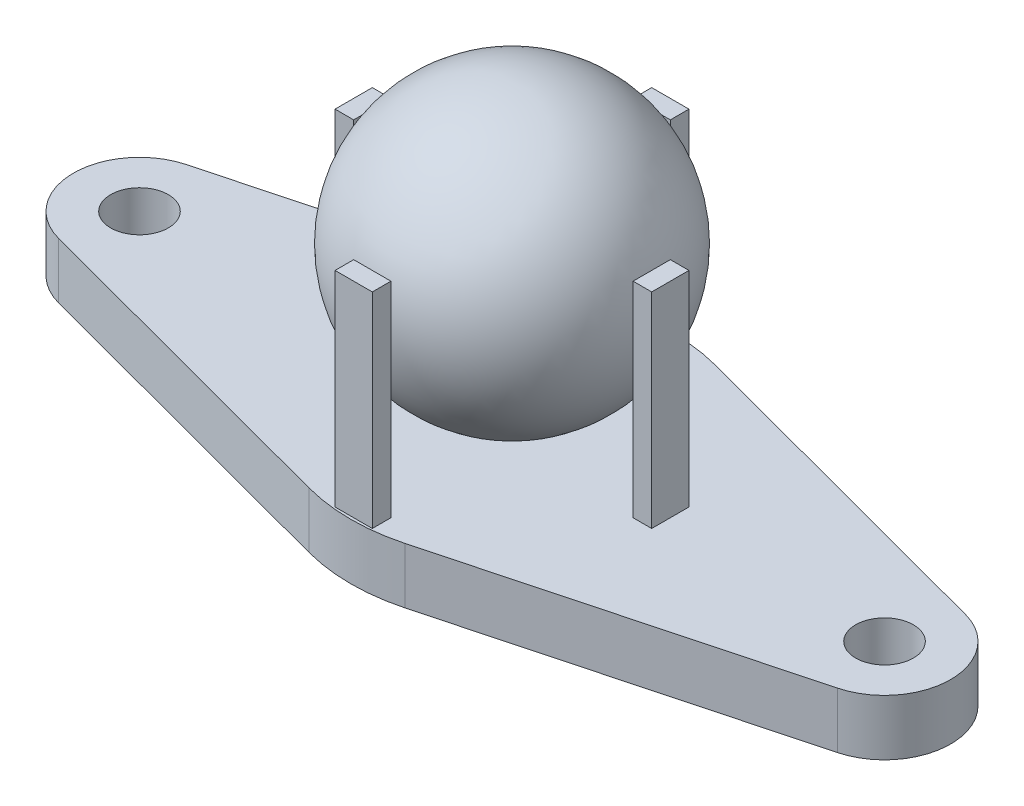
ISO-10303-21;
HEADER;
FILE_DESCRIPTION(('STEP AP214'),'2;1');
FILE_NAME('part.step','',(''),(''),'','','');
FILE_SCHEMA(('AUTOMOTIVE_DESIGN { 1 0 10303 214 1 1 1 1 }'));
ENDSEC;
DATA;
#1=APPLICATION_CONTEXT('core data for automotive mechanical design processes');
#2=APPLICATION_PROTOCOL_DEFINITION('international standard','automotive_design',2000,#1);
#3=PRODUCT_CONTEXT('',#1,'mechanical');
#4=PRODUCT('Part','Part','',(#3));
#5=PRODUCT_RELATED_PRODUCT_CATEGORY('part','',(#4));
#6=PRODUCT_DEFINITION_FORMATION('','',#4);
#7=PRODUCT_DEFINITION_CONTEXT('part definition',#1,'design');
#8=PRODUCT_DEFINITION('design','',#6,#7);
#9=PRODUCT_DEFINITION_SHAPE('','',#8);
#10=(LENGTH_UNIT() NAMED_UNIT(*) SI_UNIT(.MILLI.,.METRE.));
#11=(NAMED_UNIT(*) PLANE_ANGLE_UNIT() SI_UNIT($,.RADIAN.));
#12=(NAMED_UNIT(*) SI_UNIT($,.STERADIAN.) SOLID_ANGLE_UNIT());
#13=UNCERTAINTY_MEASURE_WITH_UNIT(LENGTH_MEASURE(1.E-05),#10,'distance_accuracy_value','');
#14=(GEOMETRIC_REPRESENTATION_CONTEXT(3) GLOBAL_UNCERTAINTY_ASSIGNED_CONTEXT((#13)) GLOBAL_UNIT_ASSIGNED_CONTEXT((#10,
#11,#12)) REPRESENTATION_CONTEXT('',''));
#15=CARTESIAN_POINT('',(0.,0.,0.));
#16=DIRECTION('',(0.,0.,1.));
#17=DIRECTION('',(1.,0.,0.));
#18=AXIS2_PLACEMENT_3D('',#15,#16,#17);
#19=CARTESIAN_POINT('',(0.,11.5,0.));
#20=DIRECTION('',(0.,-1.,0.));
#21=DIRECTION('',(-1.,0.,0.));
#22=AXIS2_PLACEMENT_3D('',#19,#20,#21);
#23=SPHERICAL_SURFACE('',#22,7.5);
#24=CARTESIAN_POINT('',(0.,4.,0.));
#25=VERTEX_POINT('',#24);
#26=VERTEX_LOOP('',#25);
#27=FACE_BOUND('',#26,.T.);
#28=ADVANCED_FACE('F52',(#27),#23,.T.);
#29=CLOSED_SHELL('',(#28));
#30=MANIFOLD_SOLID_BREP('B2',#29);
#31=CARTESIAN_POINT('',(-20.,3.,0.));
#32=DIRECTION('',(0.,-1.,0.));
#33=DIRECTION('',(0.,0.,-1.));
#34=AXIS2_PLACEMENT_3D('',#31,#32,#33);
#35=PLANE('',#34);
#36=DIRECTION('',(0.,0.,-1.));
#37=VECTOR('',#36,1.);
#38=CARTESIAN_POINT('',(1.00000000000175,3.,8.4999999999998));
#39=LINE('',#38,#37);
#40=CARTESIAN_POINT('',(1.00000000000175,3.,8.4999999999998));
#41=VERTEX_POINT('',#40);
#42=CARTESIAN_POINT('',(1.00000000000175,3.,7.4999999999998));
#43=VERTEX_POINT('',#42);
#44=EDGE_CURVE('E252',#41,#43,#39,.T.);
#45=ORIENTED_EDGE('',*,*,#44,.F.);
#46=DIRECTION('',(1.,0.,0.));
#47=VECTOR('',#46,1.);
#48=CARTESIAN_POINT('',(1.00000000000175,3.,8.4999999999998));
#49=LINE('',#48,#47);
#50=CARTESIAN_POINT('',(-0.999999999998252,3.,8.4999999999998));
#51=VERTEX_POINT('',#50);
#52=EDGE_CURVE('E270',#51,#41,#49,.T.);
#53=ORIENTED_EDGE('',*,*,#52,.F.);
#54=DIRECTION('',(0.,0.,1.));
#55=VECTOR('',#54,1.);
#56=CARTESIAN_POINT('',(-0.999999999998252,3.,8.4999999999998));
#57=LINE('',#56,#55);
#58=CARTESIAN_POINT('',(-0.999999999998252,3.,7.4999999999998));
#59=VERTEX_POINT('',#58);
#60=EDGE_CURVE('E283',#59,#51,#57,.T.);
#61=ORIENTED_EDGE('',*,*,#60,.F.);
#62=DIRECTION('',(-1.,0.,0.));
#63=VECTOR('',#62,1.);
#64=CARTESIAN_POINT('',(1.00000000000175,3.,7.4999999999998));
#65=LINE('',#64,#63);
#66=EDGE_CURVE('E258',#43,#59,#65,.T.);
#67=ORIENTED_EDGE('',*,*,#66,.F.);
#68=EDGE_LOOP('',(#45,#53,#61,#67));
#69=FACE_BOUND('',#68,.T.);
#70=DIRECTION('',(0.,0.,1.));
#71=VECTOR('',#70,1.);
#72=CARTESIAN_POINT('',(-1.,3.,-8.50000000000001));
#73=LINE('',#72,#71);
#74=CARTESIAN_POINT('',(-1.,3.,-8.50000000000001));
#75=VERTEX_POINT('',#74);
#76=CARTESIAN_POINT('',(-1.,3.,-7.50000000000001));
#77=VERTEX_POINT('',#76);
#78=EDGE_CURVE('E350',#75,#77,#73,.T.);
#79=ORIENTED_EDGE('',*,*,#78,.F.);
#80=DIRECTION('',(-1.,0.,0.));
#81=VECTOR('',#80,1.);
#82=CARTESIAN_POINT('',(-1.,3.,-8.50000000000001));
#83=LINE('',#82,#81);
#84=CARTESIAN_POINT('',(1.,3.,-8.50000000000001));
#85=VERTEX_POINT('',#84);
#86=EDGE_CURVE('E356',#85,#75,#83,.T.);
#87=ORIENTED_EDGE('',*,*,#86,.F.);
#88=DIRECTION('',(0.,0.,-1.));
#89=VECTOR('',#88,1.);
#90=CARTESIAN_POINT('',(1.,3.,-8.50000000000001));
#91=LINE('',#90,#89);
#92=CARTESIAN_POINT('',(1.,3.,-7.50000000000001));
#93=VERTEX_POINT('',#92);
#94=EDGE_CURVE('E373',#93,#85,#91,.T.);
#95=ORIENTED_EDGE('',*,*,#94,.F.);
#96=DIRECTION('',(1.,0.,0.));
#97=VECTOR('',#96,1.);
#98=CARTESIAN_POINT('',(-1.,3.,-7.50000000000001));
#99=LINE('',#98,#97);
#100=EDGE_CURVE('E369',#77,#93,#99,.T.);
#101=ORIENTED_EDGE('',*,*,#100,.F.);
#102=EDGE_LOOP('',(#79,#87,#95,#101));
#103=FACE_BOUND('',#102,.T.);
#104=DIRECTION('',(-0.966319872133039,0.,-0.257343942459868));
#105=VECTOR('',#104,1.);
#106=CARTESIAN_POINT('',(20.9135709957325,3.,-3.43043554607229));
#107=LINE('',#106,#105);
#108=CARTESIAN_POINT('',(20.9135709957325,3.,-3.43043554607229));
#109=VERTEX_POINT('',#108);
#110=CARTESIAN_POINT('',(2.57343942459867,3.,-8.31465856565071));
#111=VERTEX_POINT('',#110);
#112=EDGE_CURVE('E427',#109,#111,#107,.T.);
#113=ORIENTED_EDGE('',*,*,#112,.T.);
#114=CARTESIAN_POINT('',(0.,3.,1.34854015567967));
#115=DIRECTION('',(0.,-1.,0.));
#116=DIRECTION('',(0.,0.,-1.));
#117=AXIS2_PLACEMENT_3D('',#114,#115,#116);
#118=CIRCLE('',#117,10.);
#119=CARTESIAN_POINT('',(-2.57343942459869,3.,-8.31465856565071));
#120=VERTEX_POINT('',#119);
#121=EDGE_CURVE('E485',#111,#120,#118,.F.);
#122=ORIENTED_EDGE('',*,*,#121,.T.);
#123=DIRECTION('',(-0.966319872133039,0.,0.257343942459868));
#124=VECTOR('',#123,1.);
#125=CARTESIAN_POINT('',(-20.9135709957325,3.,-3.43043554607229));
#126=LINE('',#125,#124);
#127=CARTESIAN_POINT('',(-20.9135709957325,3.,-3.43043554607229));
#128=VERTEX_POINT('',#127);
#129=EDGE_CURVE('E431',#120,#128,#126,.T.);
#130=ORIENTED_EDGE('',*,*,#129,.T.);
#131=CARTESIAN_POINT('',(-20.,3.,0.));
#132=DIRECTION('',(0.,1.,0.));
#133=DIRECTION('',(0.,0.,-1.));
#134=AXIS2_PLACEMENT_3D('',#131,#132,#133);
#135=CIRCLE('',#134,3.55);
#136=CARTESIAN_POINT('',(-20.9135709957325,3.,3.43043554607231));
#137=VERTEX_POINT('',#136);
#138=EDGE_CURVE('E412',#128,#137,#135,.T.);
#139=ORIENTED_EDGE('',*,*,#138,.T.);
#140=DIRECTION('',(0.966319872133039,0.,0.257343942459868));
#141=VECTOR('',#140,1.);
#142=CARTESIAN_POINT('',(-20.9135709957325,3.,3.43043554607231));
#143=LINE('',#142,#141);
#144=CARTESIAN_POINT('',(-2.57343942459867,3.,8.31465856565072));
#145=VERTEX_POINT('',#144);
#146=EDGE_CURVE('E416',#137,#145,#143,.T.);
#147=ORIENTED_EDGE('',*,*,#146,.T.);
#148=CARTESIAN_POINT('',(0.,3.,-1.34854015567967));
#149=DIRECTION('',(0.,-1.,0.));
#150=DIRECTION('',(0.,0.,-1.));
#151=AXIS2_PLACEMENT_3D('',#148,#149,#150);
#152=CIRCLE('',#151,10.);
#153=CARTESIAN_POINT('',(2.57343942459869,3.,8.31465856565072));
#154=VERTEX_POINT('',#153);
#155=EDGE_CURVE('E482',#145,#154,#152,.F.);
#156=ORIENTED_EDGE('',*,*,#155,.T.);
#157=DIRECTION('',(0.966319872133039,0.,-0.257343942459868));
#158=VECTOR('',#157,1.);
#159=CARTESIAN_POINT('',(20.9135709957325,3.,3.43043554607231));
#160=LINE('',#159,#158);
#161=CARTESIAN_POINT('',(20.9135709957325,3.,3.43043554607231));
#162=VERTEX_POINT('',#161);
#163=EDGE_CURVE('E421',#154,#162,#160,.T.);
#164=ORIENTED_EDGE('',*,*,#163,.T.);
#165=CARTESIAN_POINT('',(20.,3.,0.));
#166=DIRECTION('',(0.,1.,0.));
#167=DIRECTION('',(0.,0.,1.));
#168=AXIS2_PLACEMENT_3D('',#165,#166,#167);
#169=CIRCLE('',#168,3.55);
#170=EDGE_CURVE('E424',#162,#109,#169,.T.);
#171=ORIENTED_EDGE('',*,*,#170,.T.);
#172=EDGE_LOOP('',(#113,#122,#130,#139,#147,#156,#164,#171));
#173=FACE_BOUND('',#172,.T.);
#174=CARTESIAN_POINT('',(-20.,3.,0.));
#175=DIRECTION('',(0.,1.,0.));
#176=DIRECTION('',(0.,0.,1.));
#177=AXIS2_PLACEMENT_3D('',#174,#175,#176);
#178=CIRCLE('',#177,1.55);
#179=CARTESIAN_POINT('',(-20.,3.,1.55));
#180=VERTEX_POINT('',#179);
#181=EDGE_CURVE('E404',#180,#180,#178,.T.);
#182=ORIENTED_EDGE('',*,*,#181,.F.);
#183=EDGE_LOOP('',(#182));
#184=FACE_BOUND('',#183,.T.);
#185=CARTESIAN_POINT('',(20.,3.,0.));
#186=DIRECTION('',(0.,1.,0.));
#187=DIRECTION('',(0.,0.,-1.));
#188=AXIS2_PLACEMENT_3D('',#185,#186,#187);
#189=CIRCLE('',#188,1.55);
#190=CARTESIAN_POINT('',(20.,3.,-1.55));
#191=VERTEX_POINT('',#190);
#192=EDGE_CURVE('E396',#191,#191,#189,.T.);
#193=ORIENTED_EDGE('',*,*,#192,.F.);
#194=EDGE_LOOP('',(#193));
#195=FACE_BOUND('',#194,.T.);
#196=DIRECTION('',(-1.,0.,0.));
#197=VECTOR('',#196,1.);
#198=CARTESIAN_POINT('',(8.50000000000078,3.,-1.00000000000099));
#199=LINE('',#198,#197);
#200=CARTESIAN_POINT('',(8.50000000000078,3.,-1.00000000000099));
#201=VERTEX_POINT('',#200);
#202=CARTESIAN_POINT('',(7.50000000000078,3.,-1.00000000000099));
#203=VERTEX_POINT('',#202);
#204=EDGE_CURVE('E305',#201,#203,#199,.T.);
#205=ORIENTED_EDGE('',*,*,#204,.F.);
#206=DIRECTION('',(0.,0.,-1.));
#207=VECTOR('',#206,1.);
#208=CARTESIAN_POINT('',(8.50000000000078,3.,-1.00000000000099));
#209=LINE('',#208,#207);
#210=CARTESIAN_POINT('',(8.50000000000078,3.,0.999999999999016));
#211=VERTEX_POINT('',#210);
#212=EDGE_CURVE('E311',#211,#201,#209,.T.);
#213=ORIENTED_EDGE('',*,*,#212,.F.);
#214=DIRECTION('',(1.,0.,0.));
#215=VECTOR('',#214,1.);
#216=CARTESIAN_POINT('',(8.50000000000078,3.,0.999999999999016));
#217=LINE('',#216,#215);
#218=CARTESIAN_POINT('',(7.50000000000078,3.,0.999999999999016));
#219=VERTEX_POINT('',#218);
#220=EDGE_CURVE('E328',#219,#211,#217,.T.);
#221=ORIENTED_EDGE('',*,*,#220,.F.);
#222=DIRECTION('',(0.,0.,1.));
#223=VECTOR('',#222,1.);
#224=CARTESIAN_POINT('',(7.50000000000078,3.,-1.00000000000099));
#225=LINE('',#224,#223);
#226=EDGE_CURVE('E324',#203,#219,#225,.T.);
#227=ORIENTED_EDGE('',*,*,#226,.F.);
#228=EDGE_LOOP('',(#205,#213,#221,#227));
#229=FACE_BOUND('',#228,.T.);
#230=DIRECTION('',(1.,0.,0.));
#231=VECTOR('',#230,1.);
#232=CARTESIAN_POINT('',(-8.49999999999902,3.,1.00000000000076));
#233=LINE('',#232,#231);
#234=CARTESIAN_POINT('',(-8.49999999999902,3.,1.00000000000076));
#235=VERTEX_POINT('',#234);
#236=CARTESIAN_POINT('',(-7.49999999999901,3.,1.00000000000076));
#237=VERTEX_POINT('',#236);
#238=EDGE_CURVE('E250',#235,#237,#233,.T.);
#239=ORIENTED_EDGE('',*,*,#238,.F.);
#240=DIRECTION('',(0.,0.,1.));
#241=VECTOR('',#240,1.);
#242=CARTESIAN_POINT('',(-8.49999999999902,3.,1.00000000000076));
#243=LINE('',#242,#241);
#244=CARTESIAN_POINT('',(-8.49999999999902,3.,-0.999999999999238));
#245=VERTEX_POINT('',#244);
#246=EDGE_CURVE('E247',#245,#235,#243,.T.);
#247=ORIENTED_EDGE('',*,*,#246,.F.);
#248=DIRECTION('',(-1.,0.,0.));
#249=VECTOR('',#248,1.);
#250=CARTESIAN_POINT('',(-8.49999999999902,3.,-0.999999999999238));
#251=LINE('',#250,#249);
#252=CARTESIAN_POINT('',(-7.49999999999901,3.,-0.999999999999238));
#253=VERTEX_POINT('',#252);
#254=EDGE_CURVE('E88',#253,#245,#251,.T.);
#255=ORIENTED_EDGE('',*,*,#254,.F.);
#256=DIRECTION('',(0.,0.,-1.));
#257=VECTOR('',#256,1.);
#258=CARTESIAN_POINT('',(-7.49999999999901,3.,1.00000000000076));
#259=LINE('',#258,#257);
#260=EDGE_CURVE('E83',#237,#253,#259,.T.);
#261=ORIENTED_EDGE('',*,*,#260,.F.);
#262=EDGE_LOOP('',(#239,#247,#255,#261));
#263=FACE_BOUND('',#262,.T.);
#264=ADVANCED_FACE('F67',(#69,#103,#173,#184,#195,#229,#263),#35,.F.);
#265=CARTESIAN_POINT('',(-20.,0.,0.));
#266=DIRECTION('',(0.,-1.,0.));
#267=DIRECTION('',(0.,0.,-1.));
#268=AXIS2_PLACEMENT_3D('',#265,#266,#267);
#269=PLANE('',#268);
#270=CARTESIAN_POINT('',(-20.,0.,0.));
#271=DIRECTION('',(0.,1.,0.));
#272=DIRECTION('',(0.,0.,1.));
#273=AXIS2_PLACEMENT_3D('',#270,#271,#272);
#274=CIRCLE('',#273,1.55);
#275=CARTESIAN_POINT('',(-20.,0.,1.55));
#276=VERTEX_POINT('',#275);
#277=EDGE_CURVE('E400',#276,#276,#274,.T.);
#278=ORIENTED_EDGE('',*,*,#277,.T.);
#279=EDGE_LOOP('',(#278));
#280=FACE_BOUND('',#279,.T.);
#281=DIRECTION('',(-0.966319872133039,0.,0.257343942459868));
#282=VECTOR('',#281,1.);
#283=CARTESIAN_POINT('',(-20.9135709957325,0.,-3.43043554607229));
#284=LINE('',#283,#282);
#285=CARTESIAN_POINT('',(-2.57343942459869,0.,-8.31465856565071));
#286=VERTEX_POINT('',#285);
#287=CARTESIAN_POINT('',(-20.9135709957325,0.,-3.43043554607229));
#288=VERTEX_POINT('',#287);
#289=EDGE_CURVE('E417',#286,#288,#284,.T.);
#290=ORIENTED_EDGE('',*,*,#289,.F.);
#291=CARTESIAN_POINT('',(0.,0.,1.34854015567967));
#292=DIRECTION('',(0.,-1.,0.));
#293=DIRECTION('',(0.,0.,-1.));
#294=AXIS2_PLACEMENT_3D('',#291,#292,#293);
#295=CIRCLE('',#294,10.);
#296=CARTESIAN_POINT('',(2.57343942459867,0.,-8.31465856565071));
#297=VERTEX_POINT('',#296);
#298=EDGE_CURVE('E476',#286,#297,#295,.T.);
#299=ORIENTED_EDGE('',*,*,#298,.T.);
#300=DIRECTION('',(-0.966319872133039,0.,-0.257343942459868));
#301=VECTOR('',#300,1.);
#302=CARTESIAN_POINT('',(20.9135709957325,0.,-3.43043554607229));
#303=LINE('',#302,#301);
#304=CARTESIAN_POINT('',(20.9135709957325,0.,-3.43043554607229));
#305=VERTEX_POINT('',#304);
#306=EDGE_CURVE('E448',#305,#297,#303,.T.);
#307=ORIENTED_EDGE('',*,*,#306,.F.);
#308=CARTESIAN_POINT('',(20.,0.,0.));
#309=DIRECTION('',(0.,1.,0.));
#310=DIRECTION('',(0.,0.,1.));
#311=AXIS2_PLACEMENT_3D('',#308,#309,#310);
#312=CIRCLE('',#311,3.55);
#313=CARTESIAN_POINT('',(20.9135709957325,0.,3.43043554607231));
#314=VERTEX_POINT('',#313);
#315=EDGE_CURVE('E445',#314,#305,#312,.T.);
#316=ORIENTED_EDGE('',*,*,#315,.F.);
#317=DIRECTION('',(0.966319872133039,0.,-0.257343942459868));
#318=VECTOR('',#317,1.);
#319=CARTESIAN_POINT('',(20.9135709957325,0.,3.43043554607231));
#320=LINE('',#319,#318);
#321=CARTESIAN_POINT('',(2.57343942459869,0.,8.31465856565072));
#322=VERTEX_POINT('',#321);
#323=EDGE_CURVE('E442',#322,#314,#320,.T.);
#324=ORIENTED_EDGE('',*,*,#323,.F.);
#325=CARTESIAN_POINT('',(0.,0.,-1.34854015567967));
#326=DIRECTION('',(0.,-1.,0.));
#327=DIRECTION('',(0.,0.,-1.));
#328=AXIS2_PLACEMENT_3D('',#325,#326,#327);
#329=CIRCLE('',#328,10.);
#330=CARTESIAN_POINT('',(-2.57343942459867,0.,8.31465856565072));
#331=VERTEX_POINT('',#330);
#332=EDGE_CURVE('E473',#322,#331,#329,.T.);
#333=ORIENTED_EDGE('',*,*,#332,.T.);
#334=DIRECTION('',(0.966319872133039,0.,0.257343942459868));
#335=VECTOR('',#334,1.);
#336=CARTESIAN_POINT('',(-20.9135709957325,0.,3.43043554607231));
#337=LINE('',#336,#335);
#338=CARTESIAN_POINT('',(-20.9135709957325,0.,3.43043554607231));
#339=VERTEX_POINT('',#338);
#340=EDGE_CURVE('E438',#339,#331,#337,.T.);
#341=ORIENTED_EDGE('',*,*,#340,.F.);
#342=CARTESIAN_POINT('',(-20.,0.,0.));
#343=DIRECTION('',(0.,1.,0.));
#344=DIRECTION('',(0.,0.,-1.));
#345=AXIS2_PLACEMENT_3D('',#342,#343,#344);
#346=CIRCLE('',#345,3.55);
#347=EDGE_CURVE('E408',#288,#339,#346,.T.);
#348=ORIENTED_EDGE('',*,*,#347,.F.);
#349=EDGE_LOOP('',(#290,#299,#307,#316,#324,#333,#341,#348));
#350=FACE_BOUND('',#349,.T.);
#351=CARTESIAN_POINT('',(20.,0.,0.));
#352=DIRECTION('',(0.,1.,0.));
#353=DIRECTION('',(0.,0.,-1.));
#354=AXIS2_PLACEMENT_3D('',#351,#352,#353);
#355=CIRCLE('',#354,1.55);
#356=CARTESIAN_POINT('',(20.,0.,-1.55));
#357=VERTEX_POINT('',#356);
#358=EDGE_CURVE('E395',#357,#357,#355,.T.);
#359=ORIENTED_EDGE('',*,*,#358,.T.);
#360=EDGE_LOOP('',(#359));
#361=FACE_BOUND('',#360,.T.);
#362=ADVANCED_FACE('F501',(#280,#350,#361),#269,.T.);
#363=CARTESIAN_POINT('',(-20.,3.,0.));
#364=DIRECTION('',(0.,-1.,0.));
#365=DIRECTION('',(0.,0.,-1.));
#366=AXIS2_PLACEMENT_3D('',#363,#364,#365);
#367=CYLINDRICAL_SURFACE('',#366,3.55);
#368=ORIENTED_EDGE('',*,*,#347,.T.);
#369=DIRECTION('',(0.,-1.,0.));
#370=VECTOR('',#369,1.);
#371=CARTESIAN_POINT('',(-20.9135709957325,3.,3.43043554607231));
#372=LINE('',#371,#370);
#373=EDGE_CURVE('E465',#137,#339,#372,.T.);
#374=ORIENTED_EDGE('',*,*,#373,.F.);
#375=ORIENTED_EDGE('',*,*,#138,.F.);
#376=DIRECTION('',(0.,-1.,0.));
#377=VECTOR('',#376,1.);
#378=CARTESIAN_POINT('',(-20.9135709957325,3.,-3.43043554607229));
#379=LINE('',#378,#377);
#380=EDGE_CURVE('E434',#128,#288,#379,.T.);
#381=ORIENTED_EDGE('',*,*,#380,.T.);
#382=EDGE_LOOP('',(#368,#374,#375,#381));
#383=FACE_BOUND('',#382,.T.);
#384=ADVANCED_FACE('F525',(#383),#367,.T.);
#385=CARTESIAN_POINT('',(-20.9135709957325,3.,3.43043554607231));
#386=DIRECTION('',(0.257343942459868,0.,-0.966319872133039));
#387=DIRECTION('',(-0.966319872133039,0.,-0.257343942459868));
#388=AXIS2_PLACEMENT_3D('',#385,#386,#387);
#389=PLANE('',#388);
#390=ORIENTED_EDGE('',*,*,#340,.T.);
#391=DIRECTION('',(0.,-1.,0.));
#392=VECTOR('',#391,1.);
#393=CARTESIAN_POINT('',(-2.57343942459867,3.,8.31465856565074));
#394=LINE('',#393,#392);
#395=EDGE_CURVE('E50',#331,#145,#394,.F.);
#396=ORIENTED_EDGE('',*,*,#395,.T.);
#397=ORIENTED_EDGE('',*,*,#146,.F.);
#398=ORIENTED_EDGE('',*,*,#373,.T.);
#399=EDGE_LOOP('',(#390,#396,#397,#398));
#400=FACE_BOUND('',#399,.T.);
#401=ADVANCED_FACE('F529',(#400),#389,.F.);
#402=CARTESIAN_POINT('',(20.9135709957325,3.,3.43043554607231));
#403=DIRECTION('',(-0.257343942459868,0.,-0.966319872133039));
#404=DIRECTION('',(-0.966319872133039,0.,0.257343942459868));
#405=AXIS2_PLACEMENT_3D('',#402,#403,#404);
#406=PLANE('',#405);
#407=ORIENTED_EDGE('',*,*,#163,.F.);
#408=DIRECTION('',(0.,-1.,0.));
#409=VECTOR('',#408,1.);
#410=CARTESIAN_POINT('',(2.57343942459868,3.,8.31465856565072));
#411=LINE('',#410,#409);
#412=EDGE_CURVE('E76',#154,#322,#411,.T.);
#413=ORIENTED_EDGE('',*,*,#412,.T.);
#414=ORIENTED_EDGE('',*,*,#323,.T.);
#415=DIRECTION('',(0.,-1.,0.));
#416=VECTOR('',#415,1.);
#417=CARTESIAN_POINT('',(20.9135709957325,3.,3.43043554607231));
#418=LINE('',#417,#416);
#419=EDGE_CURVE('E461',#162,#314,#418,.T.);
#420=ORIENTED_EDGE('',*,*,#419,.F.);
#421=EDGE_LOOP('',(#407,#413,#414,#420));
#422=FACE_BOUND('',#421,.T.);
#423=ADVANCED_FACE('F494',(#422),#406,.F.);
#424=CARTESIAN_POINT('',(20.,3.,0.));
#425=DIRECTION('',(0.,-1.,0.));
#426=DIRECTION('',(0.,0.,-1.));
#427=AXIS2_PLACEMENT_3D('',#424,#425,#426);
#428=CYLINDRICAL_SURFACE('',#427,3.55);
#429=ORIENTED_EDGE('',*,*,#315,.T.);
#430=DIRECTION('',(0.,-1.,0.));
#431=VECTOR('',#430,1.);
#432=CARTESIAN_POINT('',(20.9135709957325,3.,-3.43043554607229));
#433=LINE('',#432,#431);
#434=EDGE_CURVE('E457',#109,#305,#433,.T.);
#435=ORIENTED_EDGE('',*,*,#434,.F.);
#436=ORIENTED_EDGE('',*,*,#170,.F.);
#437=ORIENTED_EDGE('',*,*,#419,.T.);
#438=EDGE_LOOP('',(#429,#435,#436,#437));
#439=FACE_BOUND('',#438,.T.);
#440=ADVANCED_FACE('F506',(#439),#428,.T.);
#441=CARTESIAN_POINT('',(20.9135709957325,3.,-3.43043554607229));
#442=DIRECTION('',(-0.257343942459868,0.,0.966319872133039));
#443=DIRECTION('',(0.966319872133039,0.,0.257343942459868));
#444=AXIS2_PLACEMENT_3D('',#441,#442,#443);
#445=PLANE('',#444);
#446=ORIENTED_EDGE('',*,*,#306,.T.);
#447=DIRECTION('',(0.,-1.,0.));
#448=VECTOR('',#447,1.);
#449=CARTESIAN_POINT('',(2.57343942459867,3.,-8.31465856565072));
#450=LINE('',#449,#448);
#451=EDGE_CURVE('E479',#297,#111,#450,.F.);
#452=ORIENTED_EDGE('',*,*,#451,.T.);
#453=ORIENTED_EDGE('',*,*,#112,.F.);
#454=ORIENTED_EDGE('',*,*,#434,.T.);
#455=EDGE_LOOP('',(#446,#452,#453,#454));
#456=FACE_BOUND('',#455,.T.);
#457=ADVANCED_FACE('F510',(#456),#445,.F.);
#458=CARTESIAN_POINT('',(-20.9135709957325,3.,-3.43043554607229));
#459=DIRECTION('',(0.257343942459868,0.,0.966319872133039));
#460=DIRECTION('',(0.966319872133039,0.,-0.257343942459868));
#461=AXIS2_PLACEMENT_3D('',#458,#459,#460);
#462=PLANE('',#461);
#463=ORIENTED_EDGE('',*,*,#129,.F.);
#464=DIRECTION('',(0.,-1.,0.));
#465=VECTOR('',#464,1.);
#466=CARTESIAN_POINT('',(-2.57343942459868,3.,-8.31465856565071));
#467=LINE('',#466,#465);
#468=EDGE_CURVE('E469',#120,#286,#467,.T.);
#469=ORIENTED_EDGE('',*,*,#468,.T.);
#470=ORIENTED_EDGE('',*,*,#289,.T.);
#471=ORIENTED_EDGE('',*,*,#380,.F.);
#472=EDGE_LOOP('',(#463,#469,#470,#471));
#473=FACE_BOUND('',#472,.T.);
#474=ADVANCED_FACE('F520',(#473),#462,.F.);
#475=CARTESIAN_POINT('',(-20.,3.,0.));
#476=DIRECTION('',(0.,-1.,0.));
#477=DIRECTION('',(0.,0.,-1.));
#478=AXIS2_PLACEMENT_3D('',#475,#476,#477);
#479=CYLINDRICAL_SURFACE('',#478,1.55);
#480=ORIENTED_EDGE('',*,*,#181,.T.);
#481=EDGE_LOOP('',(#480));
#482=FACE_BOUND('',#481,.T.);
#483=ORIENTED_EDGE('',*,*,#277,.F.);
#484=EDGE_LOOP('',(#483));
#485=FACE_BOUND('',#484,.T.);
#486=ADVANCED_FACE('F548',(#482,#485),#479,.F.);
#487=CARTESIAN_POINT('',(20.,3.,0.));
#488=DIRECTION('',(0.,-1.,0.));
#489=DIRECTION('',(0.,0.,-1.));
#490=AXIS2_PLACEMENT_3D('',#487,#488,#489);
#491=CYLINDRICAL_SURFACE('',#490,1.55);
#492=ORIENTED_EDGE('',*,*,#192,.T.);
#493=EDGE_LOOP('',(#492));
#494=FACE_BOUND('',#493,.T.);
#495=ORIENTED_EDGE('',*,*,#358,.F.);
#496=EDGE_LOOP('',(#495));
#497=FACE_BOUND('',#496,.T.);
#498=ADVANCED_FACE('F571',(#494,#497),#491,.F.);
#499=CARTESIAN_POINT('',(0.,3.,1.34854015567967));
#500=DIRECTION('',(0.,-1.,0.));
#501=DIRECTION('',(0.,0.,-1.));
#502=AXIS2_PLACEMENT_3D('',#499,#500,#501);
#503=CYLINDRICAL_SURFACE('',#502,10.);
#504=ORIENTED_EDGE('',*,*,#121,.F.);
#505=ORIENTED_EDGE('',*,*,#451,.F.);
#506=ORIENTED_EDGE('',*,*,#298,.F.);
#507=ORIENTED_EDGE('',*,*,#468,.F.);
#508=EDGE_LOOP('',(#504,#505,#506,#507));
#509=FACE_BOUND('',#508,.T.);
#510=ADVANCED_FACE('F518',(#509),#503,.T.);
#511=CARTESIAN_POINT('',(0.,3.,-1.34854015567967));
#512=DIRECTION('',(0.,-1.,0.));
#513=DIRECTION('',(0.,0.,-1.));
#514=AXIS2_PLACEMENT_3D('',#511,#512,#513);
#515=CYLINDRICAL_SURFACE('',#514,10.);
#516=ORIENTED_EDGE('',*,*,#155,.F.);
#517=ORIENTED_EDGE('',*,*,#395,.F.);
#518=ORIENTED_EDGE('',*,*,#332,.F.);
#519=ORIENTED_EDGE('',*,*,#412,.F.);
#520=EDGE_LOOP('',(#516,#517,#518,#519));
#521=FACE_BOUND('',#520,.T.);
#522=ADVANCED_FACE('F69',(#521),#515,.T.);
#523=CARTESIAN_POINT('',(-1.,14.,-8.50000000000001));
#524=DIRECTION('',(1.,0.,0.));
#525=DIRECTION('',(0.,0.,-1.));
#526=AXIS2_PLACEMENT_3D('',#523,#524,#525);
#527=PLANE('',#526);
#528=ORIENTED_EDGE('',*,*,#78,.T.);
#529=DIRECTION('',(0.,-1.,0.));
#530=VECTOR('',#529,1.);
#531=CARTESIAN_POINT('',(-1.,14.,-7.50000000000001));
#532=LINE('',#531,#530);
#533=CARTESIAN_POINT('',(-1.,14.,-7.50000000000001));
#534=VERTEX_POINT('',#533);
#535=EDGE_CURVE('E391',#534,#77,#532,.T.);
#536=ORIENTED_EDGE('',*,*,#535,.F.);
#537=DIRECTION('',(0.,0.,1.));
#538=VECTOR('',#537,1.);
#539=CARTESIAN_POINT('',(-1.,14.,-8.50000000000001));
#540=LINE('',#539,#538);
#541=CARTESIAN_POINT('',(-1.,14.,-8.50000000000001));
#542=VERTEX_POINT('',#541);
#543=EDGE_CURVE('E351',#542,#534,#540,.T.);
#544=ORIENTED_EDGE('',*,*,#543,.F.);
#545=DIRECTION('',(0.,-1.,0.));
#546=VECTOR('',#545,1.);
#547=CARTESIAN_POINT('',(-1.,14.,-8.50000000000001));
#548=LINE('',#547,#546);
#549=EDGE_CURVE('E365',#542,#75,#548,.T.);
#550=ORIENTED_EDGE('',*,*,#549,.T.);
#551=EDGE_LOOP('',(#528,#536,#544,#550));
#552=FACE_BOUND('',#551,.T.);
#553=ADVANCED_FACE('F586',(#552),#527,.F.);
#554=CARTESIAN_POINT('',(-1.,14.,-7.50000000000001));
#555=DIRECTION('',(0.,0.,-1.));
#556=DIRECTION('',(-1.,0.,0.));
#557=AXIS2_PLACEMENT_3D('',#554,#555,#556);
#558=PLANE('',#557);
#559=ORIENTED_EDGE('',*,*,#100,.T.);
#560=DIRECTION('',(0.,-1.,0.));
#561=VECTOR('',#560,1.);
#562=CARTESIAN_POINT('',(1.,14.,-7.50000000000001));
#563=LINE('',#562,#561);
#564=CARTESIAN_POINT('',(1.,14.,-7.50000000000001));
#565=VERTEX_POINT('',#564);
#566=EDGE_CURVE('E387',#565,#93,#563,.T.);
#567=ORIENTED_EDGE('',*,*,#566,.F.);
#568=DIRECTION('',(1.,0.,0.));
#569=VECTOR('',#568,1.);
#570=CARTESIAN_POINT('',(-1.,14.,-7.50000000000001));
#571=LINE('',#570,#569);
#572=EDGE_CURVE('E355',#534,#565,#571,.T.);
#573=ORIENTED_EDGE('',*,*,#572,.F.);
#574=ORIENTED_EDGE('',*,*,#535,.T.);
#575=EDGE_LOOP('',(#559,#567,#573,#574));
#576=FACE_BOUND('',#575,.T.);
#577=ADVANCED_FACE('F591',(#576),#558,.F.);
#578=CARTESIAN_POINT('',(1.,14.,-8.50000000000001));
#579=DIRECTION('',(-1.,0.,0.));
#580=DIRECTION('',(0.,0.,1.));
#581=AXIS2_PLACEMENT_3D('',#578,#579,#580);
#582=PLANE('',#581);
#583=ORIENTED_EDGE('',*,*,#94,.T.);
#584=DIRECTION('',(0.,-1.,0.));
#585=VECTOR('',#584,1.);
#586=CARTESIAN_POINT('',(1.,14.,-8.50000000000001));
#587=LINE('',#586,#585);
#588=CARTESIAN_POINT('',(1.,14.,-8.50000000000001));
#589=VERTEX_POINT('',#588);
#590=EDGE_CURVE('E383',#589,#85,#587,.T.);
#591=ORIENTED_EDGE('',*,*,#590,.F.);
#592=DIRECTION('',(0.,0.,-1.));
#593=VECTOR('',#592,1.);
#594=CARTESIAN_POINT('',(1.,14.,-8.50000000000001));
#595=LINE('',#594,#593);
#596=EDGE_CURVE('E359',#565,#589,#595,.T.);
#597=ORIENTED_EDGE('',*,*,#596,.F.);
#598=ORIENTED_EDGE('',*,*,#566,.T.);
#599=EDGE_LOOP('',(#583,#591,#597,#598));
#600=FACE_BOUND('',#599,.T.);
#601=ADVANCED_FACE('F598',(#600),#582,.F.);
#602=CARTESIAN_POINT('',(-1.,14.,-8.50000000000001));
#603=DIRECTION('',(0.,0.,1.));
#604=DIRECTION('',(1.,0.,0.));
#605=AXIS2_PLACEMENT_3D('',#602,#603,#604);
#606=PLANE('',#605);
#607=ORIENTED_EDGE('',*,*,#86,.T.);
#608=ORIENTED_EDGE('',*,*,#549,.F.);
#609=DIRECTION('',(-1.,0.,0.));
#610=VECTOR('',#609,1.);
#611=CARTESIAN_POINT('',(-1.,14.,-8.50000000000001));
#612=LINE('',#611,#610);
#613=EDGE_CURVE('E362',#589,#542,#612,.T.);
#614=ORIENTED_EDGE('',*,*,#613,.F.);
#615=ORIENTED_EDGE('',*,*,#590,.T.);
#616=EDGE_LOOP('',(#607,#608,#614,#615));
#617=FACE_BOUND('',#616,.T.);
#618=ADVANCED_FACE('F605',(#617),#606,.F.);
#619=CARTESIAN_POINT('',(0.,14.,0.));
#620=DIRECTION('',(0.,1.,0.));
#621=DIRECTION('',(0.,0.,1.));
#622=AXIS2_PLACEMENT_3D('',#619,#620,#621);
#623=PLANE('',#622);
#624=ORIENTED_EDGE('',*,*,#543,.T.);
#625=ORIENTED_EDGE('',*,*,#572,.T.);
#626=ORIENTED_EDGE('',*,*,#596,.T.);
#627=ORIENTED_EDGE('',*,*,#613,.T.);
#628=EDGE_LOOP('',(#624,#625,#626,#627));
#629=FACE_BOUND('',#628,.T.);
#630=ADVANCED_FACE('F612',(#629),#623,.T.);
#631=CARTESIAN_POINT('',(8.50000000000078,14.,-1.00000000000099));
#632=DIRECTION('',(0.,0.,1.));
#633=DIRECTION('',(1.,0.,0.));
#634=AXIS2_PLACEMENT_3D('',#631,#632,#633);
#635=PLANE('',#634);
#636=ORIENTED_EDGE('',*,*,#204,.T.);
#637=DIRECTION('',(0.,-1.,0.));
#638=VECTOR('',#637,1.);
#639=CARTESIAN_POINT('',(7.50000000000078,14.,-1.00000000000099));
#640=LINE('',#639,#638);
#641=CARTESIAN_POINT('',(7.50000000000078,14.,-1.00000000000099));
#642=VERTEX_POINT('',#641);
#643=EDGE_CURVE('E346',#642,#203,#640,.T.);
#644=ORIENTED_EDGE('',*,*,#643,.F.);
#645=DIRECTION('',(-1.,0.,0.));
#646=VECTOR('',#645,1.);
#647=CARTESIAN_POINT('',(8.50000000000078,14.,-1.00000000000099));
#648=LINE('',#647,#646);
#649=CARTESIAN_POINT('',(8.50000000000078,14.,-1.00000000000099));
#650=VERTEX_POINT('',#649);
#651=EDGE_CURVE('E306',#650,#642,#648,.T.);
#652=ORIENTED_EDGE('',*,*,#651,.F.);
#653=DIRECTION('',(0.,-1.,0.));
#654=VECTOR('',#653,1.);
#655=CARTESIAN_POINT('',(8.50000000000078,14.,-1.00000000000099));
#656=LINE('',#655,#654);
#657=EDGE_CURVE('E320',#650,#201,#656,.T.);
#658=ORIENTED_EDGE('',*,*,#657,.T.);
#659=EDGE_LOOP('',(#636,#644,#652,#658));
#660=FACE_BOUND('',#659,.T.);
#661=ADVANCED_FACE('F619',(#660),#635,.F.);
#662=CARTESIAN_POINT('',(7.50000000000078,14.,-1.00000000000099));
#663=DIRECTION('',(1.,0.,0.));
#664=DIRECTION('',(0.,0.,-1.));
#665=AXIS2_PLACEMENT_3D('',#662,#663,#664);
#666=PLANE('',#665);
#667=ORIENTED_EDGE('',*,*,#226,.T.);
#668=DIRECTION('',(0.,-1.,0.));
#669=VECTOR('',#668,1.);
#670=CARTESIAN_POINT('',(7.50000000000078,14.,0.999999999999016));
#671=LINE('',#670,#669);
#672=CARTESIAN_POINT('',(7.50000000000078,14.,0.999999999999016));
#673=VERTEX_POINT('',#672);
#674=EDGE_CURVE('E342',#673,#219,#671,.T.);
#675=ORIENTED_EDGE('',*,*,#674,.F.);
#676=DIRECTION('',(0.,0.,1.));
#677=VECTOR('',#676,1.);
#678=CARTESIAN_POINT('',(7.50000000000078,14.,-1.00000000000099));
#679=LINE('',#678,#677);
#680=EDGE_CURVE('E310',#642,#673,#679,.T.);
#681=ORIENTED_EDGE('',*,*,#680,.F.);
#682=ORIENTED_EDGE('',*,*,#643,.T.);
#683=EDGE_LOOP('',(#667,#675,#681,#682));
#684=FACE_BOUND('',#683,.T.);
#685=ADVANCED_FACE('F626',(#684),#666,.F.);
#686=CARTESIAN_POINT('',(8.50000000000078,14.,0.999999999999016));
#687=DIRECTION('',(0.,0.,-1.));
#688=DIRECTION('',(-1.,0.,0.));
#689=AXIS2_PLACEMENT_3D('',#686,#687,#688);
#690=PLANE('',#689);
#691=ORIENTED_EDGE('',*,*,#220,.T.);
#692=DIRECTION('',(0.,-1.,0.));
#693=VECTOR('',#692,1.);
#694=CARTESIAN_POINT('',(8.50000000000078,14.,0.999999999999016));
#695=LINE('',#694,#693);
#696=CARTESIAN_POINT('',(8.50000000000078,14.,0.999999999999016));
#697=VERTEX_POINT('',#696);
#698=EDGE_CURVE('E338',#697,#211,#695,.T.);
#699=ORIENTED_EDGE('',*,*,#698,.F.);
#700=DIRECTION('',(1.,0.,0.));
#701=VECTOR('',#700,1.);
#702=CARTESIAN_POINT('',(8.50000000000078,14.,0.999999999999016));
#703=LINE('',#702,#701);
#704=EDGE_CURVE('E314',#673,#697,#703,.T.);
#705=ORIENTED_EDGE('',*,*,#704,.F.);
#706=ORIENTED_EDGE('',*,*,#674,.T.);
#707=EDGE_LOOP('',(#691,#699,#705,#706));
#708=FACE_BOUND('',#707,.T.);
#709=ADVANCED_FACE('F633',(#708),#690,.F.);
#710=CARTESIAN_POINT('',(8.50000000000078,14.,-1.00000000000099));
#711=DIRECTION('',(-1.,0.,0.));
#712=DIRECTION('',(0.,0.,1.));
#713=AXIS2_PLACEMENT_3D('',#710,#711,#712);
#714=PLANE('',#713);
#715=ORIENTED_EDGE('',*,*,#212,.T.);
#716=ORIENTED_EDGE('',*,*,#657,.F.);
#717=DIRECTION('',(0.,0.,-1.));
#718=VECTOR('',#717,1.);
#719=CARTESIAN_POINT('',(8.50000000000078,14.,-1.00000000000099));
#720=LINE('',#719,#718);
#721=EDGE_CURVE('E317',#697,#650,#720,.T.);
#722=ORIENTED_EDGE('',*,*,#721,.F.);
#723=ORIENTED_EDGE('',*,*,#698,.T.);
#724=EDGE_LOOP('',(#715,#716,#722,#723));
#725=FACE_BOUND('',#724,.T.);
#726=ADVANCED_FACE('F640',(#725),#714,.F.);
#727=CARTESIAN_POINT('',(0.,14.,0.));
#728=DIRECTION('',(0.,1.,0.));
#729=DIRECTION('',(0.,0.,1.));
#730=AXIS2_PLACEMENT_3D('',#727,#728,#729);
#731=PLANE('',#730);
#732=ORIENTED_EDGE('',*,*,#651,.T.);
#733=ORIENTED_EDGE('',*,*,#680,.T.);
#734=ORIENTED_EDGE('',*,*,#704,.T.);
#735=ORIENTED_EDGE('',*,*,#721,.T.);
#736=EDGE_LOOP('',(#732,#733,#734,#735));
#737=FACE_BOUND('',#736,.T.);
#738=ADVANCED_FACE('F647',(#737),#731,.T.);
#739=CARTESIAN_POINT('',(1.00000000000175,14.,8.4999999999998));
#740=DIRECTION('',(-1.,0.,0.));
#741=DIRECTION('',(0.,0.,1.));
#742=AXIS2_PLACEMENT_3D('',#739,#740,#741);
#743=PLANE('',#742);
#744=ORIENTED_EDGE('',*,*,#44,.T.);
#745=DIRECTION('',(0.,-1.,0.));
#746=VECTOR('',#745,1.);
#747=CARTESIAN_POINT('',(1.00000000000175,14.,7.4999999999998));
#748=LINE('',#747,#746);
#749=CARTESIAN_POINT('',(1.00000000000175,14.,7.4999999999998));
#750=VERTEX_POINT('',#749);
#751=EDGE_CURVE('E301',#750,#43,#748,.T.);
#752=ORIENTED_EDGE('',*,*,#751,.F.);
#753=DIRECTION('',(0.,0.,-1.));
#754=VECTOR('',#753,1.);
#755=CARTESIAN_POINT('',(1.00000000000175,14.,8.4999999999998));
#756=LINE('',#755,#754);
#757=CARTESIAN_POINT('',(1.00000000000175,14.,8.4999999999998));
#758=VERTEX_POINT('',#757);
#759=EDGE_CURVE('E265',#758,#750,#756,.T.);
#760=ORIENTED_EDGE('',*,*,#759,.F.);
#761=DIRECTION('',(0.,-1.,0.));
#762=VECTOR('',#761,1.);
#763=CARTESIAN_POINT('',(1.00000000000175,14.,8.4999999999998));
#764=LINE('',#763,#762);
#765=EDGE_CURVE('E278',#758,#41,#764,.T.);
#766=ORIENTED_EDGE('',*,*,#765,.T.);
#767=EDGE_LOOP('',(#744,#752,#760,#766));
#768=FACE_BOUND('',#767,.T.);
#769=ADVANCED_FACE('F654',(#768),#743,.F.);
#770=CARTESIAN_POINT('',(1.00000000000175,14.,7.4999999999998));
#771=DIRECTION('',(0.,0.,1.));
#772=DIRECTION('',(1.,0.,0.));
#773=AXIS2_PLACEMENT_3D('',#770,#771,#772);
#774=PLANE('',#773);
#775=ORIENTED_EDGE('',*,*,#66,.T.);
#776=DIRECTION('',(0.,-1.,0.));
#777=VECTOR('',#776,1.);
#778=CARTESIAN_POINT('',(-0.999999999998252,14.,7.4999999999998));
#779=LINE('',#778,#777);
#780=CARTESIAN_POINT('',(-0.999999999998252,14.,7.4999999999998));
#781=VERTEX_POINT('',#780);
#782=EDGE_CURVE('E297',#781,#59,#779,.T.);
#783=ORIENTED_EDGE('',*,*,#782,.F.);
#784=DIRECTION('',(-1.,0.,0.));
#785=VECTOR('',#784,1.);
#786=CARTESIAN_POINT('',(1.00000000000175,14.,7.4999999999998));
#787=LINE('',#786,#785);
#788=EDGE_CURVE('E269',#750,#781,#787,.T.);
#789=ORIENTED_EDGE('',*,*,#788,.F.);
#790=ORIENTED_EDGE('',*,*,#751,.T.);
#791=EDGE_LOOP('',(#775,#783,#789,#790));
#792=FACE_BOUND('',#791,.T.);
#793=ADVANCED_FACE('F661',(#792),#774,.F.);
#794=CARTESIAN_POINT('',(-0.999999999998252,14.,8.4999999999998));
#795=DIRECTION('',(1.,0.,0.));
#796=DIRECTION('',(0.,0.,-1.));
#797=AXIS2_PLACEMENT_3D('',#794,#795,#796);
#798=PLANE('',#797);
#799=ORIENTED_EDGE('',*,*,#60,.T.);
#800=DIRECTION('',(0.,-1.,0.));
#801=VECTOR('',#800,1.);
#802=CARTESIAN_POINT('',(-0.999999999998252,14.,8.4999999999998));
#803=LINE('',#802,#801);
#804=CARTESIAN_POINT('',(-0.999999999998252,14.,8.4999999999998));
#805=VERTEX_POINT('',#804);
#806=EDGE_CURVE('E293',#805,#51,#803,.T.);
#807=ORIENTED_EDGE('',*,*,#806,.F.);
#808=DIRECTION('',(0.,0.,1.));
#809=VECTOR('',#808,1.);
#810=CARTESIAN_POINT('',(-0.999999999998252,14.,8.4999999999998));
#811=LINE('',#810,#809);
#812=EDGE_CURVE('E273',#781,#805,#811,.T.);
#813=ORIENTED_EDGE('',*,*,#812,.F.);
#814=ORIENTED_EDGE('',*,*,#782,.T.);
#815=EDGE_LOOP('',(#799,#807,#813,#814));
#816=FACE_BOUND('',#815,.T.);
#817=ADVANCED_FACE('F668',(#816),#798,.F.);
#818=CARTESIAN_POINT('',(1.00000000000175,14.,8.4999999999998));
#819=DIRECTION('',(0.,0.,-1.));
#820=DIRECTION('',(-1.,0.,0.));
#821=AXIS2_PLACEMENT_3D('',#818,#819,#820);
#822=PLANE('',#821);
#823=ORIENTED_EDGE('',*,*,#52,.T.);
#824=ORIENTED_EDGE('',*,*,#765,.F.);
#825=DIRECTION('',(1.,0.,0.));
#826=VECTOR('',#825,1.);
#827=CARTESIAN_POINT('',(1.00000000000175,14.,8.4999999999998));
#828=LINE('',#827,#826);
#829=EDGE_CURVE('E276',#805,#758,#828,.T.);
#830=ORIENTED_EDGE('',*,*,#829,.F.);
#831=ORIENTED_EDGE('',*,*,#806,.T.);
#832=EDGE_LOOP('',(#823,#824,#830,#831));
#833=FACE_BOUND('',#832,.T.);
#834=ADVANCED_FACE('F675',(#833),#822,.F.);
#835=CARTESIAN_POINT('',(0.,14.,0.));
#836=DIRECTION('',(0.,1.,0.));
#837=DIRECTION('',(0.,0.,1.));
#838=AXIS2_PLACEMENT_3D('',#835,#836,#837);
#839=PLANE('',#838);
#840=ORIENTED_EDGE('',*,*,#759,.T.);
#841=ORIENTED_EDGE('',*,*,#788,.T.);
#842=ORIENTED_EDGE('',*,*,#812,.T.);
#843=ORIENTED_EDGE('',*,*,#829,.T.);
#844=EDGE_LOOP('',(#840,#841,#842,#843));
#845=FACE_BOUND('',#844,.T.);
#846=ADVANCED_FACE('F682',(#845),#839,.T.);
#847=CARTESIAN_POINT('',(-8.49999999999902,14.,1.00000000000076));
#848=DIRECTION('',(0.,0.,-1.));
#849=DIRECTION('',(-1.,0.,0.));
#850=AXIS2_PLACEMENT_3D('',#847,#848,#849);
#851=PLANE('',#850);
#852=ORIENTED_EDGE('',*,*,#238,.T.);
#853=DIRECTION('',(0.,-1.,0.));
#854=VECTOR('',#853,1.);
#855=CARTESIAN_POINT('',(-7.49999999999901,14.,1.00000000000076));
#856=LINE('',#855,#854);
#857=CARTESIAN_POINT('',(-7.49999999999901,14.,1.00000000000076));
#858=VERTEX_POINT('',#857);
#859=EDGE_CURVE('E229',#858,#237,#856,.T.);
#860=ORIENTED_EDGE('',*,*,#859,.F.);
#861=DIRECTION('',(1.,0.,0.));
#862=VECTOR('',#861,1.);
#863=CARTESIAN_POINT('',(-8.49999999999902,14.,1.00000000000076));
#864=LINE('',#863,#862);
#865=CARTESIAN_POINT('',(-8.49999999999902,14.,1.00000000000076));
#866=VERTEX_POINT('',#865);
#867=EDGE_CURVE('E237',#866,#858,#864,.T.);
#868=ORIENTED_EDGE('',*,*,#867,.F.);
#869=DIRECTION('',(0.,-1.,0.));
#870=VECTOR('',#869,1.);
#871=CARTESIAN_POINT('',(-8.49999999999902,14.,1.00000000000076));
#872=LINE('',#871,#870);
#873=EDGE_CURVE('E923',#866,#235,#872,.T.);
#874=ORIENTED_EDGE('',*,*,#873,.T.);
#875=EDGE_LOOP('',(#852,#860,#868,#874));
#876=FACE_BOUND('',#875,.T.);
#877=ADVANCED_FACE('F249',(#876),#851,.F.);
#878=CARTESIAN_POINT('',(-7.49999999999901,14.,1.00000000000076));
#879=DIRECTION('',(-1.,0.,0.));
#880=DIRECTION('',(0.,0.,1.));
#881=AXIS2_PLACEMENT_3D('',#878,#879,#880);
#882=PLANE('',#881);
#883=ORIENTED_EDGE('',*,*,#260,.T.);
#884=DIRECTION('',(0.,-1.,0.));
#885=VECTOR('',#884,1.);
#886=CARTESIAN_POINT('',(-7.49999999999901,14.,-0.999999999999238));
#887=LINE('',#886,#885);
#888=CARTESIAN_POINT('',(-7.49999999999901,14.,-0.999999999999238));
#889=VERTEX_POINT('',#888);
#890=EDGE_CURVE('E232',#889,#253,#887,.T.);
#891=ORIENTED_EDGE('',*,*,#890,.F.);
#892=DIRECTION('',(0.,0.,-1.));
#893=VECTOR('',#892,1.);
#894=CARTESIAN_POINT('',(-7.49999999999901,14.,1.00000000000076));
#895=LINE('',#894,#893);
#896=EDGE_CURVE('E225',#858,#889,#895,.T.);
#897=ORIENTED_EDGE('',*,*,#896,.F.);
#898=ORIENTED_EDGE('',*,*,#859,.T.);
#899=EDGE_LOOP('',(#883,#891,#897,#898));
#900=FACE_BOUND('',#899,.T.);
#901=ADVANCED_FACE('F227',(#900),#882,.F.);
#902=CARTESIAN_POINT('',(-8.49999999999902,14.,-0.999999999999238));
#903=DIRECTION('',(0.,0.,1.));
#904=DIRECTION('',(1.,0.,0.));
#905=AXIS2_PLACEMENT_3D('',#902,#903,#904);
#906=PLANE('',#905);
#907=ORIENTED_EDGE('',*,*,#254,.T.);
#908=DIRECTION('',(0.,-1.,0.));
#909=VECTOR('',#908,1.);
#910=CARTESIAN_POINT('',(-8.49999999999902,14.,-0.999999999999238));
#911=LINE('',#910,#909);
#912=CARTESIAN_POINT('',(-8.49999999999902,14.,-0.999999999999238));
#913=VERTEX_POINT('',#912);
#914=EDGE_CURVE('E261',#913,#245,#911,.T.);
#915=ORIENTED_EDGE('',*,*,#914,.F.);
#916=DIRECTION('',(-1.,0.,0.));
#917=VECTOR('',#916,1.);
#918=CARTESIAN_POINT('',(-8.49999999999902,14.,-0.999999999999238));
#919=LINE('',#918,#917);
#920=EDGE_CURVE('E236',#889,#913,#919,.T.);
#921=ORIENTED_EDGE('',*,*,#920,.F.);
#922=ORIENTED_EDGE('',*,*,#890,.T.);
#923=EDGE_LOOP('',(#907,#915,#921,#922));
#924=FACE_BOUND('',#923,.T.);
#925=ADVANCED_FACE('F700',(#924),#906,.F.);
#926=CARTESIAN_POINT('',(-8.49999999999902,14.,1.00000000000076));
#927=DIRECTION('',(1.,0.,0.));
#928=DIRECTION('',(0.,0.,-1.));
#929=AXIS2_PLACEMENT_3D('',#926,#927,#928);
#930=PLANE('',#929);
#931=ORIENTED_EDGE('',*,*,#246,.T.);
#932=ORIENTED_EDGE('',*,*,#873,.F.);
#933=DIRECTION('',(0.,0.,1.));
#934=VECTOR('',#933,1.);
#935=CARTESIAN_POINT('',(-8.49999999999902,14.,1.00000000000076));
#936=LINE('',#935,#934);
#937=EDGE_CURVE('E242',#913,#866,#936,.T.);
#938=ORIENTED_EDGE('',*,*,#937,.F.);
#939=ORIENTED_EDGE('',*,*,#914,.T.);
#940=EDGE_LOOP('',(#931,#932,#938,#939));
#941=FACE_BOUND('',#940,.T.);
#942=ADVANCED_FACE('F706',(#941),#930,.F.);
#943=CARTESIAN_POINT('',(0.,14.,0.));
#944=DIRECTION('',(0.,1.,0.));
#945=DIRECTION('',(0.,0.,1.));
#946=AXIS2_PLACEMENT_3D('',#943,#944,#945);
#947=PLANE('',#946);
#948=ORIENTED_EDGE('',*,*,#867,.T.);
#949=ORIENTED_EDGE('',*,*,#896,.T.);
#950=ORIENTED_EDGE('',*,*,#920,.T.);
#951=ORIENTED_EDGE('',*,*,#937,.T.);
#952=EDGE_LOOP('',(#948,#949,#950,#951));
#953=FACE_BOUND('',#952,.T.);
#954=ADVANCED_FACE('F240',(#953),#947,.T.);
#955=CLOSED_SHELL('',(#264,#362,#384,#401,#423,#440,#457,#474,#486,#498,#510,#522,#553,#577,
#601,#618,#630,#661,#685,#709,#726,#738,#769,#793,#817,#834,#846,#877,#901,#925,#942,#954));
#956=MANIFOLD_SOLID_BREP('B6',#955);
#957=ADVANCED_BREP_SHAPE_REPRESENTATION('',(#18,#30,#956),#14);
#958=SHAPE_DEFINITION_REPRESENTATION(#9,#957);
ENDSEC;
END-ISO-10303-21;
